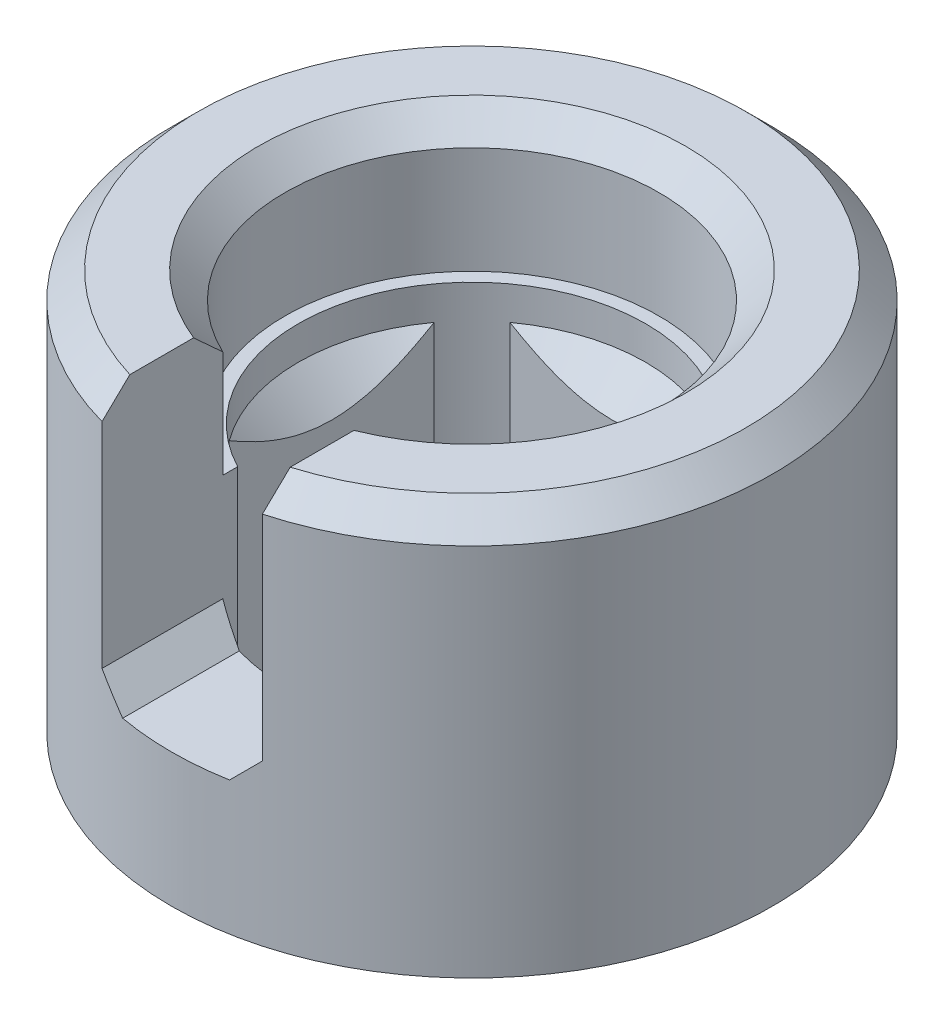
ISO-10303-21;
HEADER;
FILE_DESCRIPTION(('STEP AP214'),'2;1');
FILE_NAME('part.step','',(''),(''),'','','');
FILE_SCHEMA(('AUTOMOTIVE_DESIGN { 1 0 10303 214 1 1 1 1 }'));
ENDSEC;
DATA;
#1=APPLICATION_CONTEXT('core data for automotive mechanical design processes');
#2=APPLICATION_PROTOCOL_DEFINITION('international standard','automotive_design',2000,#1);
#3=PRODUCT_CONTEXT('',#1,'mechanical');
#4=PRODUCT('Part','Part','',(#3));
#5=PRODUCT_RELATED_PRODUCT_CATEGORY('part','',(#4));
#6=PRODUCT_DEFINITION_FORMATION('','',#4);
#7=PRODUCT_DEFINITION_CONTEXT('part definition',#1,'design');
#8=PRODUCT_DEFINITION('design','',#6,#7);
#9=PRODUCT_DEFINITION_SHAPE('','',#8);
#10=(LENGTH_UNIT() NAMED_UNIT(*) SI_UNIT(.MILLI.,.METRE.));
#11=(NAMED_UNIT(*) PLANE_ANGLE_UNIT() SI_UNIT($,.RADIAN.));
#12=(NAMED_UNIT(*) SI_UNIT($,.STERADIAN.) SOLID_ANGLE_UNIT());
#13=UNCERTAINTY_MEASURE_WITH_UNIT(LENGTH_MEASURE(1.E-05),#10,'distance_accuracy_value','');
#14=(GEOMETRIC_REPRESENTATION_CONTEXT(3) GLOBAL_UNCERTAINTY_ASSIGNED_CONTEXT((#13)) GLOBAL_UNIT_ASSIGNED_CONTEXT((#10,
#11,#12)) REPRESENTATION_CONTEXT('',''));
#15=CARTESIAN_POINT('',(0.,0.,0.));
#16=DIRECTION('',(0.,0.,1.));
#17=DIRECTION('',(1.,0.,0.));
#18=AXIS2_PLACEMENT_3D('',#15,#16,#17);
#19=CARTESIAN_POINT('',(0.,30.,0.));
#20=DIRECTION('',(0.,-1.,0.));
#21=DIRECTION('',(0.,0.,-1.));
#22=AXIS2_PLACEMENT_3D('',#19,#20,#21);
#23=CYLINDRICAL_SURFACE('',#22,14.);
#24=DIRECTION('',(0.,-1.,0.));
#25=VECTOR('',#24,1.);
#26=CARTESIAN_POINT('',(6.,30.,12.6491106406735));
#27=LINE('',#26,#25);
#28=CARTESIAN_POINT('',(6.,28.,12.6491106406735));
#29=VERTEX_POINT('',#28);
#30=CARTESIAN_POINT('',(6.,20.,12.6491106406735));
#31=VERTEX_POINT('',#30);
#32=EDGE_CURVE('E176',#29,#31,#27,.T.);
#33=ORIENTED_EDGE('',*,*,#32,.F.);
#34=CARTESIAN_POINT('',(0.,28.,0.));
#35=DIRECTION('',(0.,1.,0.));
#36=DIRECTION('',(0.,0.,1.));
#37=AXIS2_PLACEMENT_3D('',#34,#35,#36);
#38=CIRCLE('',#37,14.);
#39=CARTESIAN_POINT('',(-6.,28.,12.6491106406735));
#40=VERTEX_POINT('',#39);
#41=EDGE_CURVE('E325',#29,#40,#38,.T.);
#42=ORIENTED_EDGE('',*,*,#41,.T.);
#43=DIRECTION('',(0.,-1.,0.));
#44=VECTOR('',#43,1.);
#45=CARTESIAN_POINT('',(-6.,30.,12.6491106406735));
#46=LINE('',#45,#44);
#47=CARTESIAN_POINT('',(-6.,20.,12.6491106406735));
#48=VERTEX_POINT('',#47);
#49=EDGE_CURVE('E190',#40,#48,#46,.T.);
#50=ORIENTED_EDGE('',*,*,#49,.T.);
#51=CARTESIAN_POINT('',(0.,20.,0.));
#52=DIRECTION('',(0.,1.,0.));
#53=DIRECTION('',(0.,0.,1.));
#54=AXIS2_PLACEMENT_3D('',#51,#52,#53);
#55=CIRCLE('',#54,14.);
#56=EDGE_CURVE('E195',#31,#48,#55,.T.);
#57=ORIENTED_EDGE('',*,*,#56,.F.);
#58=EDGE_LOOP('',(#33,#42,#50,#57));
#59=FACE_BOUND('',#58,.T.);
#60=ADVANCED_FACE('F41',(#59),#23,.F.);
#61=DIRECTION('',(0.,-1.,0.));
#62=VECTOR('',#61,1.);
#63=CARTESIAN_POINT('',(-6.,20.,12.6491106406735));
#64=LINE('',#63,#62);
#65=CARTESIAN_POINT('',(-6.,12.,12.6491106406735));
#66=VERTEX_POINT('',#65);
#67=CARTESIAN_POINT('',(-6.,0.,12.6491106406735));
#68=VERTEX_POINT('',#67);
#69=EDGE_CURVE('E219',#66,#68,#64,.T.);
#70=ORIENTED_EDGE('',*,*,#69,.F.);
#71=CARTESIAN_POINT('',(0.,6.00000000000007,0.));
#72=DIRECTION('',(-0.707106781186544,-0.707106781186551,0.));
#73=DIRECTION('',(0.707106781186551,-0.707106781186544,0.));
#74=AXIS2_PLACEMENT_3D('',#71,#72,#73);
#75=ELLIPSE('',#74,19.7989898732232,14.);
#76=CARTESIAN_POINT('',(-3.99999999999998,10.,13.4164078649987));
#77=VERTEX_POINT('',#76);
#78=EDGE_CURVE('E11',#66,#77,#75,.F.);
#79=ORIENTED_EDGE('',*,*,#78,.T.);
#80=CARTESIAN_POINT('',(0.,10.,0.));
#81=DIRECTION('',(0.,1.,0.));
#82=DIRECTION('',(0.,0.,1.));
#83=AXIS2_PLACEMENT_3D('',#80,#81,#82);
#84=CIRCLE('',#83,14.);
#85=CARTESIAN_POINT('',(3.99999999999998,10.,13.4164078649987));
#86=VERTEX_POINT('',#85);
#87=EDGE_CURVE('E189',#77,#86,#84,.T.);
#88=ORIENTED_EDGE('',*,*,#87,.T.);
#89=CARTESIAN_POINT('',(0.,6.00000000000006,0.));
#90=DIRECTION('',(0.707106781186544,-0.707106781186551,0.));
#91=DIRECTION('',(-0.707106781186551,-0.707106781186544,0.));
#92=AXIS2_PLACEMENT_3D('',#89,#90,#91);
#93=ELLIPSE('',#92,19.7989898732232,14.);
#94=CARTESIAN_POINT('',(6.,12.,12.6491106406735));
#95=VERTEX_POINT('',#94);
#96=EDGE_CURVE('E57',#86,#95,#93,.F.);
#97=ORIENTED_EDGE('',*,*,#96,.T.);
#98=DIRECTION('',(0.,-1.,0.));
#99=VECTOR('',#98,1.);
#100=CARTESIAN_POINT('',(6.,20.,12.6491106406735));
#101=LINE('',#100,#99);
#102=CARTESIAN_POINT('',(6.,0.,12.6491106406735));
#103=VERTEX_POINT('',#102);
#104=EDGE_CURVE('E221',#95,#103,#101,.T.);
#105=ORIENTED_EDGE('',*,*,#104,.T.);
#106=CARTESIAN_POINT('',(0.,0.,0.));
#107=DIRECTION('',(0.,1.,0.));
#108=DIRECTION('',(0.,0.,1.));
#109=AXIS2_PLACEMENT_3D('',#106,#107,#108);
#110=CIRCLE('',#109,14.);
#111=EDGE_CURVE('E421',#68,#103,#110,.T.);
#112=ORIENTED_EDGE('',*,*,#111,.F.);
#113=EDGE_LOOP('',(#70,#79,#88,#97,#105,#112));
#114=FACE_BOUND('',#113,.T.);
#115=ADVANCED_FACE('F390',(#114),#23,.F.);
#116=CARTESIAN_POINT('',(0.,30.,0.));
#117=DIRECTION('',(0.,1.,0.));
#118=DIRECTION('',(0.,0.,1.));
#119=AXIS2_PLACEMENT_3D('',#116,#117,#118);
#120=PLANE('',#119);
#121=DIRECTION('',(0.,0.,1.));
#122=VECTOR('',#121,1.);
#123=CARTESIAN_POINT('',(-6.,30.,12.6491106406735));
#124=LINE('',#123,#122);
#125=CARTESIAN_POINT('',(-6.,30.,14.8323969741913));
#126=VERTEX_POINT('',#125);
#127=CARTESIAN_POINT('',(-6.,30.,19.6022957839127));
#128=VERTEX_POINT('',#127);
#129=EDGE_CURVE('E406',#126,#128,#124,.T.);
#130=ORIENTED_EDGE('',*,*,#129,.F.);
#131=CARTESIAN_POINT('',(0.,30.,0.));
#132=DIRECTION('',(0.,1.,0.));
#133=DIRECTION('',(0.,0.,1.));
#134=AXIS2_PLACEMENT_3D('',#131,#132,#133);
#135=CIRCLE('',#134,16.);
#136=CARTESIAN_POINT('',(6.,30.,14.8323969741913));
#137=VERTEX_POINT('',#136);
#138=EDGE_CURVE('E409',#126,#137,#135,.F.);
#139=ORIENTED_EDGE('',*,*,#138,.T.);
#140=DIRECTION('',(0.,0.,-1.));
#141=VECTOR('',#140,1.);
#142=CARTESIAN_POINT('',(6.,30.,12.6491106406735));
#143=LINE('',#142,#141);
#144=CARTESIAN_POINT('',(6.,30.,19.6022957839127));
#145=VERTEX_POINT('',#144);
#146=EDGE_CURVE('E412',#145,#137,#143,.T.);
#147=ORIENTED_EDGE('',*,*,#146,.F.);
#148=CARTESIAN_POINT('',(0.,30.,0.));
#149=DIRECTION('',(0.,1.,0.));
#150=DIRECTION('',(0.,0.,1.));
#151=AXIS2_PLACEMENT_3D('',#148,#149,#150);
#152=CIRCLE('',#151,20.5);
#153=EDGE_CURVE('E411',#145,#128,#152,.T.);
#154=ORIENTED_EDGE('',*,*,#153,.T.);
#155=EDGE_LOOP('',(#130,#139,#147,#154));
#156=FACE_BOUND('',#155,.T.);
#157=ADVANCED_FACE('F396',(#156),#120,.T.);
#158=CARTESIAN_POINT('',(0.,30.,0.));
#159=DIRECTION('',(0.,-1.,0.));
#160=DIRECTION('',(0.,0.,-1.));
#161=AXIS2_PLACEMENT_3D('',#158,#159,#160);
#162=CYLINDRICAL_SURFACE('',#161,22.5);
#163=CARTESIAN_POINT('',(0.,0.,0.));
#164=DIRECTION('',(0.,1.,0.));
#165=DIRECTION('',(0.,0.,1.));
#166=AXIS2_PLACEMENT_3D('',#163,#164,#165);
#167=CIRCLE('',#166,22.5);
#168=CARTESIAN_POINT('',(0.,0.,22.5));
#169=VERTEX_POINT('',#168);
#170=EDGE_CURVE('E424',#169,#169,#167,.T.);
#171=ORIENTED_EDGE('',*,*,#170,.T.);
#172=EDGE_LOOP('',(#171));
#173=FACE_BOUND('',#172,.T.);
#174=DIRECTION('',(0.,-1.,0.));
#175=VECTOR('',#174,1.);
#176=CARTESIAN_POINT('',(-6.,30.,21.6852484422014));
#177=LINE('',#176,#175);
#178=CARTESIAN_POINT('',(-6.,28.,21.6852484422014));
#179=VERTEX_POINT('',#178);
#180=CARTESIAN_POINT('',(-6.,12.,21.6852484422014));
#181=VERTEX_POINT('',#180);
#182=EDGE_CURVE('E322',#179,#181,#177,.T.);
#183=ORIENTED_EDGE('',*,*,#182,.F.);
#184=CARTESIAN_POINT('',(0.,28.,0.));
#185=DIRECTION('',(0.,1.,0.));
#186=DIRECTION('',(0.,0.,1.));
#187=AXIS2_PLACEMENT_3D('',#184,#185,#186);
#188=CIRCLE('',#187,22.5);
#189=CARTESIAN_POINT('',(6.,28.,21.6852484422014));
#190=VERTEX_POINT('',#189);
#191=EDGE_CURVE('E370',#179,#190,#188,.F.);
#192=ORIENTED_EDGE('',*,*,#191,.T.);
#193=DIRECTION('',(0.,-1.,0.));
#194=VECTOR('',#193,1.);
#195=CARTESIAN_POINT('',(6.,30.,21.6852484422014));
#196=LINE('',#195,#194);
#197=CARTESIAN_POINT('',(6.,12.,21.6852484422014));
#198=VERTEX_POINT('',#197);
#199=EDGE_CURVE('E319',#198,#190,#196,.F.);
#200=ORIENTED_EDGE('',*,*,#199,.F.);
#201=CARTESIAN_POINT('',(0.,6.00000000000006,0.));
#202=DIRECTION('',(0.707106781186544,-0.707106781186551,0.));
#203=DIRECTION('',(-0.707106781186551,-0.707106781186544,0.));
#204=AXIS2_PLACEMENT_3D('',#201,#202,#203);
#205=ELLIPSE('',#204,31.8198051533945,22.5);
#206=CARTESIAN_POINT('',(3.99999999999998,10.,22.1415898254845));
#207=VERTEX_POINT('',#206);
#208=EDGE_CURVE('E605',#198,#207,#205,.T.);
#209=ORIENTED_EDGE('',*,*,#208,.T.);
#210=CARTESIAN_POINT('',(0.,10.,0.));
#211=DIRECTION('',(0.,1.,0.));
#212=DIRECTION('',(0.,0.,1.));
#213=AXIS2_PLACEMENT_3D('',#210,#211,#212);
#214=CIRCLE('',#213,22.5);
#215=CARTESIAN_POINT('',(-3.99999999999998,10.,22.1415898254845));
#216=VERTEX_POINT('',#215);
#217=EDGE_CURVE('E316',#216,#207,#214,.T.);
#218=ORIENTED_EDGE('',*,*,#217,.F.);
#219=CARTESIAN_POINT('',(0.,6.00000000000007,0.));
#220=DIRECTION('',(-0.707106781186544,-0.707106781186551,0.));
#221=DIRECTION('',(0.707106781186551,-0.707106781186544,0.));
#222=AXIS2_PLACEMENT_3D('',#219,#220,#221);
#223=ELLIPSE('',#222,31.8198051533945,22.5);
#224=EDGE_CURVE('E50',#216,#181,#223,.T.);
#225=ORIENTED_EDGE('',*,*,#224,.T.);
#226=EDGE_LOOP('',(#183,#192,#200,#209,#218,#225));
#227=FACE_BOUND('',#226,.T.);
#228=ADVANCED_FACE('F307',(#173,#227),#162,.T.);
#229=CARTESIAN_POINT('',(0.,20.,0.));
#230=DIRECTION('',(0.,-1.,0.));
#231=DIRECTION('',(0.,0.,-1.));
#232=AXIS2_PLACEMENT_3D('',#229,#230,#231);
#233=CYLINDRICAL_SURFACE('',#232,13.);
#234=DIRECTION('',(0.,-1.,0.));
#235=VECTOR('',#234,1.);
#236=CARTESIAN_POINT('',(10.5,15.,-7.66485485837795));
#237=LINE('',#236,#235);
#238=CARTESIAN_POINT('',(10.5,17.5,-7.66485485837795));
#239=VERTEX_POINT('',#238);
#240=CARTESIAN_POINT('',(10.5,0.,-7.66485485837795));
#241=VERTEX_POINT('',#240);
#242=EDGE_CURVE('E451',#239,#241,#237,.T.);
#243=ORIENTED_EDGE('',*,*,#242,.F.);
#244=CARTESIAN_POINT('',(0.,17.5,0.));
#245=DIRECTION('',(0.,1.,0.));
#246=DIRECTION('',(0.,0.,1.));
#247=AXIS2_PLACEMENT_3D('',#244,#245,#246);
#248=CIRCLE('',#247,13.);
#249=CARTESIAN_POINT('',(10.5,17.5,7.66485485837795));
#250=VERTEX_POINT('',#249);
#251=EDGE_CURVE('E231',#239,#250,#248,.F.);
#252=ORIENTED_EDGE('',*,*,#251,.T.);
#253=DIRECTION('',(0.,-1.,0.));
#254=VECTOR('',#253,1.);
#255=CARTESIAN_POINT('',(10.5,15.,7.66485485837795));
#256=LINE('',#255,#254);
#257=CARTESIAN_POINT('',(10.5,0.,7.66485485837795));
#258=VERTEX_POINT('',#257);
#259=EDGE_CURVE('E448',#250,#258,#256,.T.);
#260=ORIENTED_EDGE('',*,*,#259,.T.);
#261=CARTESIAN_POINT('',(0.,0.,0.));
#262=DIRECTION('',(0.,-1.,0.));
#263=DIRECTION('',(0.,0.,1.));
#264=AXIS2_PLACEMENT_3D('',#261,#262,#263);
#265=CIRCLE('',#264,13.);
#266=CARTESIAN_POINT('',(6.,0.,11.5325625946708));
#267=VERTEX_POINT('',#266);
#268=EDGE_CURVE('E212',#258,#267,#265,.T.);
#269=ORIENTED_EDGE('',*,*,#268,.T.);
#270=DIRECTION('',(0.,-1.,0.));
#271=VECTOR('',#270,1.);
#272=CARTESIAN_POINT('',(6.,20.,11.5325625946708));
#273=LINE('',#272,#271);
#274=CARTESIAN_POINT('',(6.,20.,11.5325625946708));
#275=VERTEX_POINT('',#274);
#276=EDGE_CURVE('E223',#275,#267,#273,.T.);
#277=ORIENTED_EDGE('',*,*,#276,.F.);
#278=CARTESIAN_POINT('',(0.,20.,0.));
#279=DIRECTION('',(0.,-1.,0.));
#280=DIRECTION('',(0.,0.,1.));
#281=AXIS2_PLACEMENT_3D('',#278,#279,#280);
#282=CIRCLE('',#281,13.);
#283=CARTESIAN_POINT('',(-6.,20.,11.5325625946708));
#284=VERTEX_POINT('',#283);
#285=EDGE_CURVE('E198',#284,#275,#282,.T.);
#286=ORIENTED_EDGE('',*,*,#285,.F.);
#287=DIRECTION('',(0.,-1.,0.));
#288=VECTOR('',#287,1.);
#289=CARTESIAN_POINT('',(-6.,20.,11.5325625946708));
#290=LINE('',#289,#288);
#291=CARTESIAN_POINT('',(-6.,0.,11.5325625946708));
#292=VERTEX_POINT('',#291);
#293=EDGE_CURVE('E204',#284,#292,#290,.T.);
#294=ORIENTED_EDGE('',*,*,#293,.T.);
#295=CARTESIAN_POINT('',(-10.5,0.,7.66485485837795));
#296=VERTEX_POINT('',#295);
#297=EDGE_CURVE('E208',#292,#296,#265,.T.);
#298=ORIENTED_EDGE('',*,*,#297,.T.);
#299=DIRECTION('',(0.,-1.,0.));
#300=VECTOR('',#299,1.);
#301=CARTESIAN_POINT('',(-10.5,15.,7.66485485837795));
#302=LINE('',#301,#300);
#303=CARTESIAN_POINT('',(-10.5,17.5,7.66485485837795));
#304=VERTEX_POINT('',#303);
#305=EDGE_CURVE('E427',#304,#296,#302,.T.);
#306=ORIENTED_EDGE('',*,*,#305,.F.);
#307=CARTESIAN_POINT('',(0.,17.5,0.));
#308=DIRECTION('',(0.,1.,0.));
#309=DIRECTION('',(0.,0.,1.));
#310=AXIS2_PLACEMENT_3D('',#307,#308,#309);
#311=CIRCLE('',#310,13.);
#312=CARTESIAN_POINT('',(-10.5,17.5,-7.66485485837795));
#313=VERTEX_POINT('',#312);
#314=EDGE_CURVE('E225',#304,#313,#311,.F.);
#315=ORIENTED_EDGE('',*,*,#314,.T.);
#316=DIRECTION('',(0.,-1.,0.));
#317=VECTOR('',#316,1.);
#318=CARTESIAN_POINT('',(-10.5,15.,-7.66485485837795));
#319=LINE('',#318,#317);
#320=CARTESIAN_POINT('',(-10.5,0.,-7.66485485837795));
#321=VERTEX_POINT('',#320);
#322=EDGE_CURVE('E430',#313,#321,#319,.T.);
#323=ORIENTED_EDGE('',*,*,#322,.T.);
#324=CARTESIAN_POINT('',(-7.66485485837795,0.,-10.5));
#325=VERTEX_POINT('',#324);
#326=EDGE_CURVE('E211',#321,#325,#265,.T.);
#327=ORIENTED_EDGE('',*,*,#326,.T.);
#328=DIRECTION('',(0.,-1.,0.));
#329=VECTOR('',#328,1.);
#330=CARTESIAN_POINT('',(-7.66485485837795,15.,-10.5));
#331=LINE('',#330,#329);
#332=CARTESIAN_POINT('',(-7.66485485837795,17.5,-10.5));
#333=VERTEX_POINT('',#332);
#334=EDGE_CURVE('E436',#333,#325,#331,.T.);
#335=ORIENTED_EDGE('',*,*,#334,.F.);
#336=CARTESIAN_POINT('',(0.,17.5,0.));
#337=DIRECTION('',(0.,1.,0.));
#338=DIRECTION('',(0.,0.,1.));
#339=AXIS2_PLACEMENT_3D('',#336,#337,#338);
#340=CIRCLE('',#339,13.);
#341=CARTESIAN_POINT('',(7.66485485837795,17.5,-10.5));
#342=VERTEX_POINT('',#341);
#343=EDGE_CURVE('E228',#333,#342,#340,.F.);
#344=ORIENTED_EDGE('',*,*,#343,.T.);
#345=DIRECTION('',(0.,-1.,0.));
#346=VECTOR('',#345,1.);
#347=CARTESIAN_POINT('',(7.66485485837795,15.,-10.5));
#348=LINE('',#347,#346);
#349=CARTESIAN_POINT('',(7.66485485837795,0.,-10.5));
#350=VERTEX_POINT('',#349);
#351=EDGE_CURVE('E439',#342,#350,#348,.T.);
#352=ORIENTED_EDGE('',*,*,#351,.T.);
#353=EDGE_CURVE('E454',#350,#241,#265,.T.);
#354=ORIENTED_EDGE('',*,*,#353,.T.);
#355=EDGE_LOOP('',(#243,#252,#260,#269,#277,#286,#294,#298,#306,#315,#323,#327,#335,#344,#352,#354));
#356=FACE_BOUND('',#355,.T.);
#357=ADVANCED_FACE('F265',(#356),#233,.F.);
#358=CARTESIAN_POINT('',(6.,20.,11.5325625946708));
#359=DIRECTION('',(1.,0.,0.));
#360=DIRECTION('',(0.,0.,-1.));
#361=AXIS2_PLACEMENT_3D('',#358,#359,#360);
#362=PLANE('',#361);
#363=ORIENTED_EDGE('',*,*,#146,.T.);
#364=CARTESIAN_POINT('',(6.,30.,14.8323969741913));
#365=CARTESIAN_POINT('',(6.,29.8322559857427,14.6514457707989));
#366=CARTESIAN_POINT('',(6.,29.6647415936314,14.470281418627));
#367=CARTESIAN_POINT('',(6.,29.3302312572995,14.1074781512519));
#368=CARTESIAN_POINT('',(6.,29.1632353078364,13.9258392408819));
#369=CARTESIAN_POINT('',(6.,28.8298173375424,13.5620345762846));
#370=CARTESIAN_POINT('',(6.,28.6633953178033,13.3798688210564));
#371=CARTESIAN_POINT('',(6.,28.3311958228234,13.0149472498521));
#372=CARTESIAN_POINT('',(6.,28.1654183541432,12.8321914279045));
#373=CARTESIAN_POINT('',(6.,28.,12.6491106406735));
#374=B_SPLINE_CURVE_WITH_KNOTS('',3,(#364,#365,#366,#367,#368,#369,#370,#371,#372,#373),
.UNSPECIFIED.,.F.,.F.,(4,2,2,2,4),(0.,0.740224750028115,1.48044199036571,2.2206606380072,
2.96088680047043),.UNSPECIFIED.);
#375=EDGE_CURVE('E184',#137,#29,#374,.T.);
#376=ORIENTED_EDGE('',*,*,#375,.T.);
#377=ORIENTED_EDGE('',*,*,#32,.T.);
#378=DIRECTION('',(0.,0.,1.));
#379=VECTOR('',#378,1.);
#380=CARTESIAN_POINT('',(6.,20.,11.5325625946708));
#381=LINE('',#380,#379);
#382=EDGE_CURVE('E181',#275,#31,#381,.T.);
#383=ORIENTED_EDGE('',*,*,#382,.F.);
#384=ORIENTED_EDGE('',*,*,#276,.T.);
#385=DIRECTION('',(0.,0.,1.));
#386=VECTOR('',#385,1.);
#387=CARTESIAN_POINT('',(6.,0.,11.5325625946708));
#388=LINE('',#387,#386);
#389=EDGE_CURVE('E210',#267,#103,#388,.T.);
#390=ORIENTED_EDGE('',*,*,#389,.T.);
#391=ORIENTED_EDGE('',*,*,#104,.F.);
#392=DIRECTION('',(0.,0.,1.));
#393=VECTOR('',#392,1.);
#394=CARTESIAN_POINT('',(6.,12.,11.5325625946708));
#395=LINE('',#394,#393);
#396=EDGE_CURVE('E414',#95,#198,#395,.T.);
#397=ORIENTED_EDGE('',*,*,#396,.T.);
#398=ORIENTED_EDGE('',*,*,#199,.T.);
#399=CARTESIAN_POINT('',(6.,28.,21.6852484422014));
#400=CARTESIAN_POINT('',(6.,28.1669921254485,21.5119817952065));
#401=CARTESIAN_POINT('',(6.,28.3339108181876,21.338644354597));
#402=CARTESIAN_POINT('',(6.,28.6675895364936,20.9918171481932));
#403=CARTESIAN_POINT('',(6.,28.8343495622141,20.8183273825466));
#404=CARTESIAN_POINT('',(6.,29.1676994891085,20.4711844308046));
#405=CARTESIAN_POINT('',(6.,29.3342893902611,20.2975312446886));
#406=CARTESIAN_POINT('',(6.,29.6672857161289,19.9500487265879));
#407=CARTESIAN_POINT('',(6.,29.8336921406662,19.7762193944326));
#408=CARTESIAN_POINT('',(6.,30.,19.6022957839127));
#409=B_SPLINE_CURVE_WITH_KNOTS('',3,(#399,#400,#401,#402,#403,#404,#405,#406,#407,#408),
.UNSPECIFIED.,.F.,.F.,(4,2,2,2,4),(0.,0.721920568424739,1.44384043764591,2.16576039721304,
2.88768105612921),.UNSPECIFIED.);
#410=EDGE_CURVE('E358',#190,#145,#409,.T.);
#411=ORIENTED_EDGE('',*,*,#410,.T.);
#412=EDGE_LOOP('',(#363,#376,#377,#383,#384,#390,#391,#397,#398,#411));
#413=FACE_BOUND('',#412,.T.);
#414=ADVANCED_FACE('F179',(#413),#362,.F.);
#415=CARTESIAN_POINT('',(-6.,20.,11.5325625946708));
#416=DIRECTION('',(-1.,0.,0.));
#417=DIRECTION('',(0.,0.,1.));
#418=AXIS2_PLACEMENT_3D('',#415,#416,#417);
#419=PLANE('',#418);
#420=ORIENTED_EDGE('',*,*,#49,.F.);
#421=CARTESIAN_POINT('',(-6.,28.,12.6491106406735));
#422=CARTESIAN_POINT('',(-6.,28.1654183541432,12.8321914279045));
#423=CARTESIAN_POINT('',(-6.,28.3311958228234,13.0149472498521));
#424=CARTESIAN_POINT('',(-6.,28.6633953178033,13.3798688210564));
#425=CARTESIAN_POINT('',(-6.,28.8298173375424,13.5620345762846));
#426=CARTESIAN_POINT('',(-6.,29.1632353078364,13.9258392408819));
#427=CARTESIAN_POINT('',(-6.,29.3302312572995,14.1074781512519));
#428=CARTESIAN_POINT('',(-6.,29.6647415936314,14.470281418627));
#429=CARTESIAN_POINT('',(-6.,29.8322559857427,14.6514457707989));
#430=CARTESIAN_POINT('',(-6.,30.,14.8323969741913));
#431=B_SPLINE_CURVE_WITH_KNOTS('',3,(#421,#422,#423,#424,#425,#426,#427,#428,#429,#430),
.UNSPECIFIED.,.F.,.F.,(4,2,2,2,4),(0.,0.740226162463234,1.48044481010472,2.22066205044232,
2.96088680047043),.UNSPECIFIED.);
#432=EDGE_CURVE('E338',#40,#126,#431,.T.);
#433=ORIENTED_EDGE('',*,*,#432,.T.);
#434=ORIENTED_EDGE('',*,*,#129,.T.);
#435=CARTESIAN_POINT('',(-6.,30.,19.6022957839127));
#436=CARTESIAN_POINT('',(-6.,29.8336921406662,19.7762193944326));
#437=CARTESIAN_POINT('',(-6.,29.6672857161289,19.9500487265879));
#438=CARTESIAN_POINT('',(-6.,29.3342893902611,20.2975312446886));
#439=CARTESIAN_POINT('',(-6.,29.1676994891085,20.4711844308046));
#440=CARTESIAN_POINT('',(-6.,28.8343495622141,20.8183273825466));
#441=CARTESIAN_POINT('',(-6.,28.6675895364936,20.9918171481932));
#442=CARTESIAN_POINT('',(-6.,28.3339108181876,21.338644354597));
#443=CARTESIAN_POINT('',(-6.,28.1669921254485,21.5119817952065));
#444=CARTESIAN_POINT('',(-6.,28.,21.6852484422014));
#445=B_SPLINE_CURVE_WITH_KNOTS('',3,(#435,#436,#437,#438,#439,#440,#441,#442,#443,#444),
.UNSPECIFIED.,.F.,.F.,(4,2,2,2,4),(0.,0.721920658916168,1.4438406184833,2.16576048770447,
2.88768105612921),.UNSPECIFIED.);
#446=EDGE_CURVE('E330',#128,#179,#445,.T.);
#447=ORIENTED_EDGE('',*,*,#446,.T.);
#448=ORIENTED_EDGE('',*,*,#182,.T.);
#449=DIRECTION('',(0.,0.,-1.));
#450=VECTOR('',#449,1.);
#451=CARTESIAN_POINT('',(-6.,12.,11.5325625946708));
#452=LINE('',#451,#450);
#453=EDGE_CURVE('E327',#181,#66,#452,.T.);
#454=ORIENTED_EDGE('',*,*,#453,.T.);
#455=ORIENTED_EDGE('',*,*,#69,.T.);
#456=DIRECTION('',(0.,0.,-1.));
#457=VECTOR('',#456,1.);
#458=CARTESIAN_POINT('',(-6.,0.,11.5325625946708));
#459=LINE('',#458,#457);
#460=EDGE_CURVE('E215',#68,#292,#459,.T.);
#461=ORIENTED_EDGE('',*,*,#460,.T.);
#462=ORIENTED_EDGE('',*,*,#293,.F.);
#463=DIRECTION('',(0.,0.,-1.));
#464=VECTOR('',#463,1.);
#465=CARTESIAN_POINT('',(-6.,20.,11.5325625946708));
#466=LINE('',#465,#464);
#467=EDGE_CURVE('E202',#48,#284,#466,.T.);
#468=ORIENTED_EDGE('',*,*,#467,.F.);
#469=EDGE_LOOP('',(#420,#433,#434,#447,#448,#454,#455,#461,#462,#468));
#470=FACE_BOUND('',#469,.T.);
#471=ADVANCED_FACE('F347',(#470),#419,.F.);
#472=CARTESIAN_POINT('',(0.,20.,0.));
#473=DIRECTION('',(0.,1.,0.));
#474=DIRECTION('',(0.,0.,1.));
#475=AXIS2_PLACEMENT_3D('',#472,#473,#474);
#476=PLANE('',#475);
#477=ORIENTED_EDGE('',*,*,#285,.T.);
#478=ORIENTED_EDGE('',*,*,#382,.T.);
#479=ORIENTED_EDGE('',*,*,#56,.T.);
#480=ORIENTED_EDGE('',*,*,#467,.T.);
#481=EDGE_LOOP('',(#477,#478,#479,#480));
#482=FACE_BOUND('',#481,.T.);
#483=ADVANCED_FACE('F194',(#482),#476,.T.);
#484=CARTESIAN_POINT('',(0.,0.,0.));
#485=DIRECTION('',(0.,1.,0.));
#486=DIRECTION('',(0.,0.,1.));
#487=AXIS2_PLACEMENT_3D('',#484,#485,#486);
#488=PLANE('',#487);
#489=ORIENTED_EDGE('',*,*,#297,.F.);
#490=ORIENTED_EDGE('',*,*,#460,.F.);
#491=ORIENTED_EDGE('',*,*,#111,.T.);
#492=ORIENTED_EDGE('',*,*,#389,.F.);
#493=ORIENTED_EDGE('',*,*,#268,.F.);
#494=DIRECTION('',(0.,0.,1.));
#495=VECTOR('',#494,1.);
#496=CARTESIAN_POINT('',(10.5,0.,7.66485485837795));
#497=LINE('',#496,#495);
#498=EDGE_CURVE('E445',#241,#258,#497,.T.);
#499=ORIENTED_EDGE('',*,*,#498,.F.);
#500=ORIENTED_EDGE('',*,*,#353,.F.);
#501=DIRECTION('',(1.,0.,0.));
#502=VECTOR('',#501,1.);
#503=CARTESIAN_POINT('',(-7.66485485837795,0.,-10.5));
#504=LINE('',#503,#502);
#505=EDGE_CURVE('E442',#325,#350,#504,.T.);
#506=ORIENTED_EDGE('',*,*,#505,.F.);
#507=ORIENTED_EDGE('',*,*,#326,.F.);
#508=DIRECTION('',(0.,0.,-1.));
#509=VECTOR('',#508,1.);
#510=CARTESIAN_POINT('',(-10.5,0.,-7.66485485837795));
#511=LINE('',#510,#509);
#512=EDGE_CURVE('E433',#296,#321,#511,.T.);
#513=ORIENTED_EDGE('',*,*,#512,.F.);
#514=EDGE_LOOP('',(#489,#490,#491,#492,#493,#499,#500,#506,#507,#513));
#515=FACE_BOUND('',#514,.T.);
#516=ORIENTED_EDGE('',*,*,#170,.F.);
#517=EDGE_LOOP('',(#516));
#518=FACE_BOUND('',#517,.T.);
#519=ADVANCED_FACE('F352',(#515,#518),#488,.F.);
#520=CARTESIAN_POINT('',(10.5,15.,7.66485485837795));
#521=DIRECTION('',(1.,0.,0.));
#522=DIRECTION('',(0.,0.,-1.));
#523=AXIS2_PLACEMENT_3D('',#520,#521,#522);
#524=PLANE('',#523);
#525=ORIENTED_EDGE('',*,*,#498,.T.);
#526=ORIENTED_EDGE('',*,*,#259,.F.);
#527=CARTESIAN_POINT('',(10.5,17.5,7.66485485837795));
#528=CARTESIAN_POINT('',(10.5,17.3892570895595,7.47700461954886));
#529=CARTESIAN_POINT('',(10.5,17.280457337825,7.28799278895277));
#530=CARTESIAN_POINT('',(10.5,17.0673150561455,6.90741370018092));
#531=CARTESIAN_POINT('',(10.5,16.9629736371329,6.71584582051177));
#532=CARTESIAN_POINT('',(10.5,16.7590148451731,6.32933392959095));
#533=CARTESIAN_POINT('',(10.5,16.6594154585821,6.13438038389206));
#534=CARTESIAN_POINT('',(10.5,16.4660737975147,5.74161354711144));
#535=CARTESIAN_POINT('',(10.5,16.3723310969294,5.54380046537048));
#536=CARTESIAN_POINT('',(10.5,16.1056581740633,4.95594043728532));
#537=CARTESIAN_POINT('',(10.5,15.9419984261687,4.56160430859229));
#538=CARTESIAN_POINT('',(10.5,15.6471918148897,3.7613469156427));
#539=CARTESIAN_POINT('',(10.5,15.5159983063046,3.35544321759749));
#540=CARTESIAN_POINT('',(10.5,15.3406727087814,2.7060613934243));
#541=CARTESIAN_POINT('',(10.5,15.2831452061367,2.46617991742449));
#542=CARTESIAN_POINT('',(10.5,15.1830584074547,1.98330292873296));
#543=CARTESIAN_POINT('',(10.5,15.14049787751,1.74030767446011));
#544=CARTESIAN_POINT('',(10.5,15.0711254830235,1.24850080776722));
#545=CARTESIAN_POINT('',(10.5,15.0445468925631,0.999655669441886));
#546=CARTESIAN_POINT('',(10.5,15.0178696611014,0.625391880548791));
#547=CARTESIAN_POINT('',(10.5,15.0111756544543,0.500415676516953));
#548=CARTESIAN_POINT('',(10.5,15.0022383706945,0.250296648196638));
#549=CARTESIAN_POINT('',(10.5,14.9999953714255,0.125153813994563));
#550=CARTESIAN_POINT('',(10.5,15.,0.));
#551=B_SPLINE_CURVE_WITH_KNOTS('',3,(#527,#528,#529,#530,#531,#532,#533,#534,#535,#536,#537,
#538,#539,#540,#541,#542,#543,#544,#545,#546,#547,#548,#549,#550),.UNSPECIFIED.,.F.,.F.,(4,2,2,
2,2,2,2,2,2,2,2,4),(0.,0.654198611333977,1.3085592971194,1.9652311086253,2.62185508757769,
3.90157972537444,5.17945492907893,5.91909512483163,6.65867432884998,7.40880183029872,
7.78419838204722,8.15961836629588),.UNSPECIFIED.);
#552=CARTESIAN_POINT('',(10.5,15.,0.));
#553=VERTEX_POINT('',#552);
#554=EDGE_CURVE('E243',#250,#553,#551,.T.);
#555=ORIENTED_EDGE('',*,*,#554,.T.);
#556=CARTESIAN_POINT('',(10.5,15.,0.));
#557=CARTESIAN_POINT('',(10.5,14.9999812231615,-0.161387267217322));
#558=CARTESIAN_POINT('',(10.5,15.0037203400075,-0.322768074559366));
#559=CARTESIAN_POINT('',(10.5,15.0185748226426,-0.645164743344335));
#560=CARTESIAN_POINT('',(10.5,15.0296890002868,-0.806180659380415));
#561=CARTESIAN_POINT('',(10.5,15.0591262533951,-1.12724346440632));
#562=CARTESIAN_POINT('',(10.5,15.0774356390482,-1.28729161094748));
#563=CARTESIAN_POINT('',(10.5,15.1209992843534,-1.60643318637707));
#564=CARTESIAN_POINT('',(10.5,15.146253759793,-1.76552658544406));
#565=CARTESIAN_POINT('',(10.5,15.231012362532,-2.2357361143481));
#566=CARTESIAN_POINT('',(10.5,15.3000285876259,-2.54517568591781));
#567=CARTESIAN_POINT('',(10.5,15.4606659101197,-3.15814135004501));
#568=CARTESIAN_POINT('',(10.5,15.5522963067921,-3.46166495433091));
#569=CARTESIAN_POINT('',(10.5,15.7676433009093,-4.10014624956411));
#570=CARTESIAN_POINT('',(10.5,15.8939523314386,-4.43422420240215));
#571=CARTESIAN_POINT('',(10.5,16.1666123843162,-5.09413584332688));
#572=CARTESIAN_POINT('',(10.5,16.3129707861666,-5.41996644327845));
#573=CARTESIAN_POINT('',(10.5,16.6249582238103,-6.07022405759493));
#574=CARTESIAN_POINT('',(10.5,16.7909130409308,-6.39449383558448));
#575=CARTESIAN_POINT('',(10.5,17.049876699381,-6.8751403021325));
#576=CARTESIAN_POINT('',(10.5,17.1378060307607,-7.03428881291955));
#577=CARTESIAN_POINT('',(10.5,17.3167030407276,-7.35084351453484));
#578=CARTESIAN_POINT('',(10.5,17.4076703324812,-7.50824992381792));
#579=CARTESIAN_POINT('',(10.5,17.5,-7.66485485837795));
#580=B_SPLINE_CURVE_WITH_KNOTS('',3,(#556,#557,#558,#559,#560,#561,#562,#563,#564,#565,#566,
#567,#568,#569,#570,#571,#572,#573,#574,#575,#576,#577,#578,#579),.UNSPECIFIED.,.F.,.F.,(4,2,2,
2,2,2,2,2,2,2,2,4),(0.,0.484107770457709,0.968137568601089,1.45125086200313,1.93437916767606,
2.88443185325402,3.83487586700628,4.90553196628964,5.97658320236449,7.06896868324795,
7.61441308528505,8.15978829692968),.UNSPECIFIED.);
#581=EDGE_CURVE('E234',#553,#239,#580,.T.);
#582=ORIENTED_EDGE('',*,*,#581,.T.);
#583=ORIENTED_EDGE('',*,*,#242,.T.);
#584=EDGE_LOOP('',(#525,#526,#555,#582,#583));
#585=FACE_BOUND('',#584,.T.);
#586=ADVANCED_FACE('F249',(#585),#524,.F.);
#587=CARTESIAN_POINT('',(-7.66485485837795,15.,-10.5));
#588=DIRECTION('',(0.,0.,-1.));
#589=DIRECTION('',(-1.,0.,0.));
#590=AXIS2_PLACEMENT_3D('',#587,#588,#589);
#591=PLANE('',#590);
#592=ORIENTED_EDGE('',*,*,#505,.T.);
#593=ORIENTED_EDGE('',*,*,#351,.F.);
#594=CARTESIAN_POINT('',(7.66485485837795,17.5,-10.5));
#595=CARTESIAN_POINT('',(7.47700461954886,17.3892570895595,-10.5));
#596=CARTESIAN_POINT('',(7.28799278895277,17.280457337825,-10.5));
#597=CARTESIAN_POINT('',(6.90741370018092,17.0673150561455,-10.5));
#598=CARTESIAN_POINT('',(6.71584582051177,16.9629736371329,-10.5));
#599=CARTESIAN_POINT('',(6.32933392959095,16.7590148451731,-10.5));
#600=CARTESIAN_POINT('',(6.13438038389206,16.6594154585821,-10.5));
#601=CARTESIAN_POINT('',(5.74161354711144,16.4660737975147,-10.5));
#602=CARTESIAN_POINT('',(5.54380046537048,16.3723310969294,-10.5));
#603=CARTESIAN_POINT('',(4.95594043728532,16.1056581740633,-10.5));
#604=CARTESIAN_POINT('',(4.56160430859229,15.9419984261687,-10.5));
#605=CARTESIAN_POINT('',(3.7613469156427,15.6471918148897,-10.5));
#606=CARTESIAN_POINT('',(3.35544321759749,15.5159983063046,-10.5));
#607=CARTESIAN_POINT('',(2.7060613934243,15.3406727087814,-10.5));
#608=CARTESIAN_POINT('',(2.46617991742449,15.2831452061367,-10.5));
#609=CARTESIAN_POINT('',(1.98330292873296,15.1830584074547,-10.5));
#610=CARTESIAN_POINT('',(1.74030767446011,15.14049787751,-10.5));
#611=CARTESIAN_POINT('',(1.24850080776722,15.0711254830235,-10.5));
#612=CARTESIAN_POINT('',(0.999655669441886,15.0445468925631,-10.5));
#613=CARTESIAN_POINT('',(0.625391880548791,15.0178696611014,-10.5));
#614=CARTESIAN_POINT('',(0.500415676516953,15.0111756544543,-10.5));
#615=CARTESIAN_POINT('',(0.250296648196638,15.0022383706945,-10.5));
#616=CARTESIAN_POINT('',(0.125153813994563,14.9999953714255,-10.5));
#617=CARTESIAN_POINT('',(0.,15.,-10.5));
#618=B_SPLINE_CURVE_WITH_KNOTS('',3,(#594,#595,#596,#597,#598,#599,#600,#601,#602,#603,#604,
#605,#606,#607,#608,#609,#610,#611,#612,#613,#614,#615,#616,#617),.UNSPECIFIED.,.F.,.F.,(4,2,2,
2,2,2,2,2,2,2,2,4),(0.,0.654198611333977,1.3085592971194,1.9652311086253,2.62185508757769,
3.90157972537444,5.17945492907893,5.91909512483163,6.65867432884998,7.40880183029872,
7.78419838204722,8.15961836629588),.UNSPECIFIED.);
#619=CARTESIAN_POINT('',(0.,15.,-10.5));
#620=VERTEX_POINT('',#619);
#621=EDGE_CURVE('E285',#342,#620,#618,.T.);
#622=ORIENTED_EDGE('',*,*,#621,.T.);
#623=CARTESIAN_POINT('',(0.,15.,-10.5));
#624=CARTESIAN_POINT('',(-0.161387267217322,14.9999812231615,-10.5));
#625=CARTESIAN_POINT('',(-0.322768074559366,15.0037203400075,-10.5));
#626=CARTESIAN_POINT('',(-0.645164743344335,15.0185748226426,-10.5));
#627=CARTESIAN_POINT('',(-0.806180659380415,15.0296890002868,-10.5));
#628=CARTESIAN_POINT('',(-1.12724346440632,15.0591262533951,-10.5));
#629=CARTESIAN_POINT('',(-1.28729161094748,15.0774356390482,-10.5));
#630=CARTESIAN_POINT('',(-1.60643318637707,15.1209992843534,-10.5));
#631=CARTESIAN_POINT('',(-1.76552658544406,15.146253759793,-10.5));
#632=CARTESIAN_POINT('',(-2.2357361143481,15.231012362532,-10.5));
#633=CARTESIAN_POINT('',(-2.54517568591781,15.3000285876259,-10.5));
#634=CARTESIAN_POINT('',(-3.15814135004501,15.4606659101197,-10.5));
#635=CARTESIAN_POINT('',(-3.46166495433091,15.5522963067921,-10.5));
#636=CARTESIAN_POINT('',(-4.10014624956411,15.7676433009093,-10.5));
#637=CARTESIAN_POINT('',(-4.43422420240215,15.8939523314386,-10.5));
#638=CARTESIAN_POINT('',(-5.09413584332688,16.1666123843162,-10.5));
#639=CARTESIAN_POINT('',(-5.41996644327845,16.3129707861666,-10.5));
#640=CARTESIAN_POINT('',(-6.07022405759493,16.6249582238103,-10.5));
#641=CARTESIAN_POINT('',(-6.39449383558448,16.7909130409308,-10.5));
#642=CARTESIAN_POINT('',(-6.8751403021325,17.049876699381,-10.5));
#643=CARTESIAN_POINT('',(-7.03428881291955,17.1378060307607,-10.5));
#644=CARTESIAN_POINT('',(-7.35084351453484,17.3167030407276,-10.5));
#645=CARTESIAN_POINT('',(-7.50824992381792,17.4076703324812,-10.5));
#646=CARTESIAN_POINT('',(-7.66485485837795,17.5,-10.5));
#647=B_SPLINE_CURVE_WITH_KNOTS('',3,(#623,#624,#625,#626,#627,#628,#629,#630,#631,#632,#633,
#634,#635,#636,#637,#638,#639,#640,#641,#642,#643,#644,#645,#646),.UNSPECIFIED.,.F.,.F.,(4,2,2,
2,2,2,2,2,2,2,2,4),(0.,0.484107770457709,0.968137568601089,1.45125086200313,1.93437916767606,
2.88443185325402,3.83487586700628,4.90553196628964,5.97658320236449,7.06896868324795,
7.61441308528505,8.15978829692968),.UNSPECIFIED.);
#648=EDGE_CURVE('E279',#620,#333,#647,.T.);
#649=ORIENTED_EDGE('',*,*,#648,.T.);
#650=ORIENTED_EDGE('',*,*,#334,.T.);
#651=EDGE_LOOP('',(#592,#593,#622,#649,#650));
#652=FACE_BOUND('',#651,.T.);
#653=ADVANCED_FACE('F298',(#652),#591,.F.);
#654=CARTESIAN_POINT('',(-10.5,15.,-7.66485485837795));
#655=DIRECTION('',(-1.,0.,0.));
#656=DIRECTION('',(0.,0.,1.));
#657=AXIS2_PLACEMENT_3D('',#654,#655,#656);
#658=PLANE('',#657);
#659=ORIENTED_EDGE('',*,*,#512,.T.);
#660=ORIENTED_EDGE('',*,*,#322,.F.);
#661=CARTESIAN_POINT('',(-10.5,17.5,-7.66485485837795));
#662=CARTESIAN_POINT('',(-10.5,17.3892570895595,-7.47700461954886));
#663=CARTESIAN_POINT('',(-10.5,17.280457337825,-7.28799278895277));
#664=CARTESIAN_POINT('',(-10.5,17.0673150561455,-6.90741370018092));
#665=CARTESIAN_POINT('',(-10.5,16.9629736371329,-6.71584582051177));
#666=CARTESIAN_POINT('',(-10.5,16.7590148451731,-6.32933392959095));
#667=CARTESIAN_POINT('',(-10.5,16.6594154585821,-6.13438038389206));
#668=CARTESIAN_POINT('',(-10.5,16.4660737975147,-5.74161354711144));
#669=CARTESIAN_POINT('',(-10.5,16.3723310969294,-5.54380046537048));
#670=CARTESIAN_POINT('',(-10.5,16.1056581740633,-4.95594043728532));
#671=CARTESIAN_POINT('',(-10.5,15.9419984261687,-4.5616043085923));
#672=CARTESIAN_POINT('',(-10.5,15.6471918148897,-3.7613469156427));
#673=CARTESIAN_POINT('',(-10.5,15.5159983063046,-3.35544321759749));
#674=CARTESIAN_POINT('',(-10.5,15.3406727087814,-2.7060613934243));
#675=CARTESIAN_POINT('',(-10.5,15.2831452061367,-2.46617991742449));
#676=CARTESIAN_POINT('',(-10.5,15.1830584074547,-1.98330292873296));
#677=CARTESIAN_POINT('',(-10.5,15.14049787751,-1.74030767446011));
#678=CARTESIAN_POINT('',(-10.5,15.0711254830235,-1.24850080776722));
#679=CARTESIAN_POINT('',(-10.5,15.0445468925631,-0.999655669441886));
#680=CARTESIAN_POINT('',(-10.5,15.0178696611014,-0.625391880548792));
#681=CARTESIAN_POINT('',(-10.5,15.0111756544543,-0.500415676516954));
#682=CARTESIAN_POINT('',(-10.5,15.0022383706945,-0.250296648196638));
#683=CARTESIAN_POINT('',(-10.5,14.9999953714255,-0.125153813994564));
#684=CARTESIAN_POINT('',(-10.5,15.,0.));
#685=B_SPLINE_CURVE_WITH_KNOTS('',3,(#661,#662,#663,#664,#665,#666,#667,#668,#669,#670,#671,
#672,#673,#674,#675,#676,#677,#678,#679,#680,#681,#682,#683,#684),.UNSPECIFIED.,.F.,.F.,(4,2,2,
2,2,2,2,2,2,2,2,4),(0.,0.654198611333975,1.3085592971194,1.96523110862529,2.62185508757769,
3.90157972537444,5.17945492907894,5.91909512483163,6.65867432884998,7.40880183029872,
7.78419838204722,8.15961836629588),.UNSPECIFIED.);
#686=CARTESIAN_POINT('',(-10.5,15.,0.));
#687=VERTEX_POINT('',#686);
#688=EDGE_CURVE('E310',#313,#687,#685,.T.);
#689=ORIENTED_EDGE('',*,*,#688,.T.);
#690=CARTESIAN_POINT('',(-10.5,15.,0.));
#691=CARTESIAN_POINT('',(-10.5,14.9999812231615,0.161387267217322));
#692=CARTESIAN_POINT('',(-10.5,15.0037203400075,0.322768074559367));
#693=CARTESIAN_POINT('',(-10.5,15.0185748226426,0.645164743344335));
#694=CARTESIAN_POINT('',(-10.5,15.0296890002868,0.806180659380415));
#695=CARTESIAN_POINT('',(-10.5,15.0591262533951,1.12724346440632));
#696=CARTESIAN_POINT('',(-10.5,15.0774356390482,1.28729161094748));
#697=CARTESIAN_POINT('',(-10.5,15.1209992843534,1.60643318637707));
#698=CARTESIAN_POINT('',(-10.5,15.146253759793,1.76552658544406));
#699=CARTESIAN_POINT('',(-10.5,15.231012362532,2.2357361143481));
#700=CARTESIAN_POINT('',(-10.5,15.3000285876259,2.54517568591781));
#701=CARTESIAN_POINT('',(-10.5,15.4606659101197,3.15814135004501));
#702=CARTESIAN_POINT('',(-10.5,15.5522963067921,3.46166495433091));
#703=CARTESIAN_POINT('',(-10.5,15.7676433009093,4.10014624956411));
#704=CARTESIAN_POINT('',(-10.5,15.8939523314386,4.43422420240215));
#705=CARTESIAN_POINT('',(-10.5,16.1666123843162,5.09413584332688));
#706=CARTESIAN_POINT('',(-10.5,16.3129707861666,5.41996644327845));
#707=CARTESIAN_POINT('',(-10.5,16.6249582238103,6.07022405759493));
#708=CARTESIAN_POINT('',(-10.5,16.7909130409308,6.39449383558448));
#709=CARTESIAN_POINT('',(-10.5,17.049876699381,6.8751403021325));
#710=CARTESIAN_POINT('',(-10.5,17.1378060307607,7.03428881291955));
#711=CARTESIAN_POINT('',(-10.5,17.3167030407276,7.35084351453484));
#712=CARTESIAN_POINT('',(-10.5,17.4076703324812,7.50824992381792));
#713=CARTESIAN_POINT('',(-10.5,17.5,7.66485485837795));
#714=B_SPLINE_CURVE_WITH_KNOTS('',3,(#690,#691,#692,#693,#694,#695,#696,#697,#698,#699,#700,
#701,#702,#703,#704,#705,#706,#707,#708,#709,#710,#711,#712,#713),.UNSPECIFIED.,.F.,.F.,(4,2,2,
2,2,2,2,2,2,2,2,4),(0.,0.484107770457709,0.968137568601089,1.45125086200313,1.93437916767606,
2.88443185325402,3.83487586700628,4.90553196628964,5.97658320236449,7.06896868324795,
7.61441308528505,8.15978829692968),.UNSPECIFIED.);
#715=EDGE_CURVE('E291',#687,#304,#714,.T.);
#716=ORIENTED_EDGE('',*,*,#715,.T.);
#717=ORIENTED_EDGE('',*,*,#305,.T.);
#718=EDGE_LOOP('',(#659,#660,#689,#716,#717));
#719=FACE_BOUND('',#718,.T.);
#720=ADVANCED_FACE('F263',(#719),#658,.F.);
#721=CARTESIAN_POINT('',(0.,15.,0.));
#722=DIRECTION('',(0.,1.,0.));
#723=DIRECTION('',(0.,0.,1.));
#724=AXIS2_PLACEMENT_3D('',#721,#722,#723);
#725=CONICAL_SURFACE('',#724,10.5,0.785398163397453);
#726=ORIENTED_EDGE('',*,*,#554,.F.);
#727=ORIENTED_EDGE('',*,*,#251,.F.);
#728=ORIENTED_EDGE('',*,*,#581,.F.);
#729=EDGE_LOOP('',(#726,#727,#728));
#730=FACE_BOUND('',#729,.T.);
#731=ADVANCED_FACE('F254',(#730),#725,.F.);
#732=CARTESIAN_POINT('',(0.,15.,0.));
#733=DIRECTION('',(0.,1.,0.));
#734=DIRECTION('',(0.,0.,1.));
#735=AXIS2_PLACEMENT_3D('',#732,#733,#734);
#736=CONICAL_SURFACE('',#735,10.5,0.785398163397453);
#737=ORIENTED_EDGE('',*,*,#621,.F.);
#738=ORIENTED_EDGE('',*,*,#343,.F.);
#739=ORIENTED_EDGE('',*,*,#648,.F.);
#740=EDGE_LOOP('',(#737,#738,#739));
#741=FACE_BOUND('',#740,.T.);
#742=ADVANCED_FACE('F262',(#741),#736,.F.);
#743=CARTESIAN_POINT('',(0.,15.,0.));
#744=DIRECTION('',(0.,1.,0.));
#745=DIRECTION('',(0.,0.,1.));
#746=AXIS2_PLACEMENT_3D('',#743,#744,#745);
#747=CONICAL_SURFACE('',#746,10.5,0.785398163397453);
#748=ORIENTED_EDGE('',*,*,#688,.F.);
#749=ORIENTED_EDGE('',*,*,#314,.F.);
#750=ORIENTED_EDGE('',*,*,#715,.F.);
#751=EDGE_LOOP('',(#748,#749,#750));
#752=FACE_BOUND('',#751,.T.);
#753=ADVANCED_FACE('F274',(#752),#747,.F.);
#754=CARTESIAN_POINT('',(0.,10.,0.));
#755=DIRECTION('',(0.,1.,0.));
#756=DIRECTION('',(0.,0.,1.));
#757=AXIS2_PLACEMENT_3D('',#754,#755,#756);
#758=PLANE('',#757);
#759=ORIENTED_EDGE('',*,*,#217,.T.);
#760=DIRECTION('',(0.,0.,-1.));
#761=VECTOR('',#760,1.);
#762=CARTESIAN_POINT('',(3.99999999999998,10.,0.));
#763=LINE('',#762,#761);
#764=EDGE_CURVE('E601',#207,#86,#763,.T.);
#765=ORIENTED_EDGE('',*,*,#764,.T.);
#766=ORIENTED_EDGE('',*,*,#87,.F.);
#767=DIRECTION('',(0.,0.,1.));
#768=VECTOR('',#767,1.);
#769=CARTESIAN_POINT('',(-3.99999999999998,10.,0.));
#770=LINE('',#769,#768);
#771=EDGE_CURVE('E599',#77,#216,#770,.T.);
#772=ORIENTED_EDGE('',*,*,#771,.T.);
#773=EDGE_LOOP('',(#759,#765,#766,#772));
#774=FACE_BOUND('',#773,.T.);
#775=ADVANCED_FACE('F378',(#774),#758,.T.);
#776=CARTESIAN_POINT('',(0.,28.,0.));
#777=DIRECTION('',(0.,1.,0.));
#778=DIRECTION('',(0.,0.,1.));
#779=AXIS2_PLACEMENT_3D('',#776,#777,#778);
#780=CONICAL_SURFACE('',#779,14.,0.785398163397452);
#781=ORIENTED_EDGE('',*,*,#375,.F.);
#782=ORIENTED_EDGE('',*,*,#138,.F.);
#783=ORIENTED_EDGE('',*,*,#432,.F.);
#784=ORIENTED_EDGE('',*,*,#41,.F.);
#785=EDGE_LOOP('',(#781,#782,#783,#784));
#786=FACE_BOUND('',#785,.T.);
#787=ADVANCED_FACE('F373',(#786),#780,.F.);
#788=CARTESIAN_POINT('',(0.,30.,0.));
#789=DIRECTION('',(0.,-1.,0.));
#790=DIRECTION('',(0.,0.,-1.));
#791=AXIS2_PLACEMENT_3D('',#788,#789,#790);
#792=CONICAL_SURFACE('',#791,20.5,0.785398163397447);
#793=ORIENTED_EDGE('',*,*,#410,.F.);
#794=ORIENTED_EDGE('',*,*,#191,.F.);
#795=ORIENTED_EDGE('',*,*,#446,.F.);
#796=ORIENTED_EDGE('',*,*,#153,.F.);
#797=EDGE_LOOP('',(#793,#794,#795,#796));
#798=FACE_BOUND('',#797,.T.);
#799=ADVANCED_FACE('F345',(#798),#792,.T.);
#800=CARTESIAN_POINT('',(3.99999999999998,10.,0.));
#801=DIRECTION('',(0.707106781186544,-0.707106781186551,0.));
#802=DIRECTION('',(0.,0.,-1.));
#803=AXIS2_PLACEMENT_3D('',#800,#801,#802);
#804=PLANE('',#803);
#805=ORIENTED_EDGE('',*,*,#208,.F.);
#806=ORIENTED_EDGE('',*,*,#396,.F.);
#807=ORIENTED_EDGE('',*,*,#96,.F.);
#808=ORIENTED_EDGE('',*,*,#764,.F.);
#809=EDGE_LOOP('',(#805,#806,#807,#808));
#810=FACE_BOUND('',#809,.T.);
#811=ADVANCED_FACE('F385',(#810),#804,.F.);
#812=CARTESIAN_POINT('',(-3.99999999999998,10.,0.));
#813=DIRECTION('',(-0.707106781186544,-0.707106781186551,0.));
#814=DIRECTION('',(0.,0.,1.));
#815=AXIS2_PLACEMENT_3D('',#812,#813,#814);
#816=PLANE('',#815);
#817=ORIENTED_EDGE('',*,*,#78,.F.);
#818=ORIENTED_EDGE('',*,*,#453,.F.);
#819=ORIENTED_EDGE('',*,*,#224,.F.);
#820=ORIENTED_EDGE('',*,*,#771,.F.);
#821=EDGE_LOOP('',(#817,#818,#819,#820));
#822=FACE_BOUND('',#821,.T.);
#823=ADVANCED_FACE('F44',(#822),#816,.F.);
#824=CLOSED_SHELL('',(#60,#115,#157,#228,#357,#414,#471,#483,#519,#586,#653,#720,#731,#742,#753,
#775,#787,#799,#811,#823));
#825=MANIFOLD_SOLID_BREP('B2',#824);
#826=ADVANCED_BREP_SHAPE_REPRESENTATION('',(#18,#825),#14);
#827=SHAPE_DEFINITION_REPRESENTATION(#9,#826);
ENDSEC;
END-ISO-10303-21;
